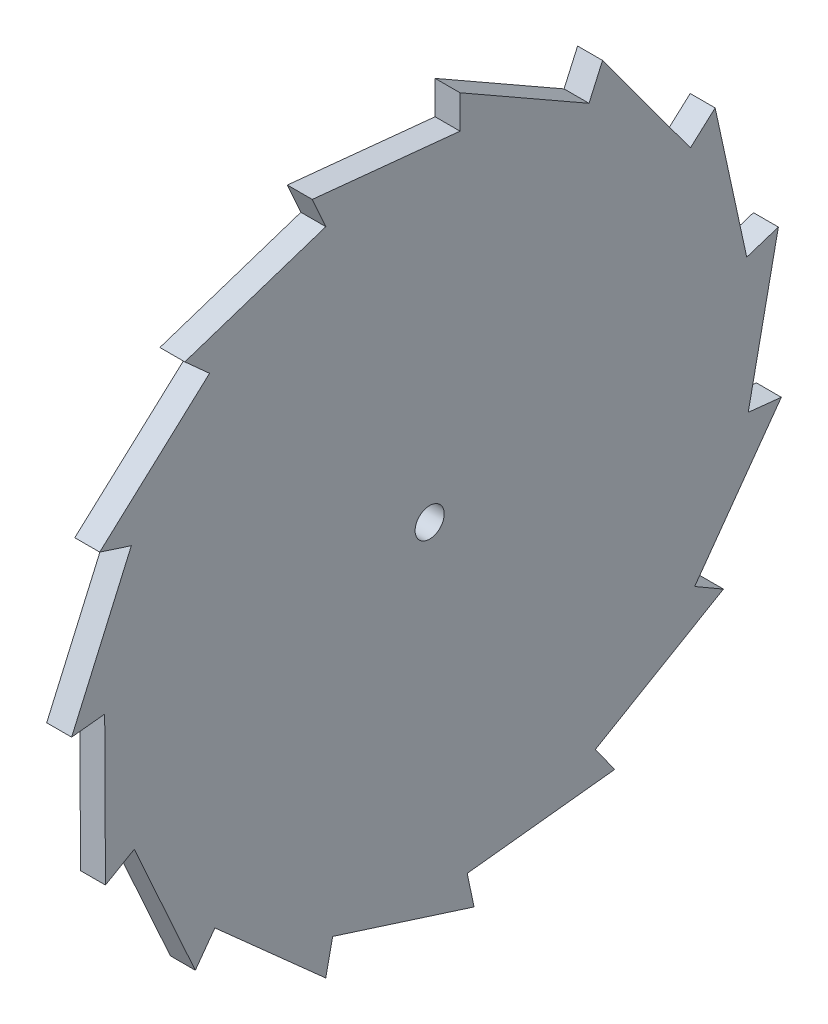
ISO-10303-21;
HEADER;
FILE_DESCRIPTION(('STEP AP214'),'2;1');
FILE_NAME('part.step','',(''),(''),'','','');
FILE_SCHEMA(('AUTOMOTIVE_DESIGN { 1 0 10303 214 1 1 1 1 }'));
ENDSEC;
DATA;
#1=APPLICATION_CONTEXT('core data for automotive mechanical design processes');
#2=APPLICATION_PROTOCOL_DEFINITION('international standard','automotive_design',2000,#1);
#3=PRODUCT_CONTEXT('',#1,'mechanical');
#4=PRODUCT('Part','Part','',(#3));
#5=PRODUCT_RELATED_PRODUCT_CATEGORY('part','',(#4));
#6=PRODUCT_DEFINITION_FORMATION('','',#4);
#7=PRODUCT_DEFINITION_CONTEXT('part definition',#1,'design');
#8=PRODUCT_DEFINITION('design','',#6,#7);
#9=PRODUCT_DEFINITION_SHAPE('','',#8);
#10=(LENGTH_UNIT() NAMED_UNIT(*) SI_UNIT(.MILLI.,.METRE.));
#11=(NAMED_UNIT(*) PLANE_ANGLE_UNIT() SI_UNIT($,.RADIAN.));
#12=(NAMED_UNIT(*) SI_UNIT($,.STERADIAN.) SOLID_ANGLE_UNIT());
#13=UNCERTAINTY_MEASURE_WITH_UNIT(LENGTH_MEASURE(1.E-05),#10,'distance_accuracy_value','');
#14=(GEOMETRIC_REPRESENTATION_CONTEXT(3) GLOBAL_UNCERTAINTY_ASSIGNED_CONTEXT((#13)) GLOBAL_UNIT_ASSIGNED_CONTEXT((#10,
#11,#12)) REPRESENTATION_CONTEXT('',''));
#15=CARTESIAN_POINT('',(0.,0.,0.));
#16=DIRECTION('',(0.,0.,1.));
#17=DIRECTION('',(1.,0.,0.));
#18=AXIS2_PLACEMENT_3D('',#15,#16,#17);
#19=CARTESIAN_POINT('',(6.,89.7129427659909,64.4689110371826));
#20=DIRECTION('',(0.,0.995040767531425,-0.0994679393094666));
#21=DIRECTION('',(0.,0.0994679393094667,0.995040767531426));
#22=AXIS2_PLACEMENT_3D('',#19,#20,#21);
#23=PLANE('',#22);
#24=DIRECTION('',(0.,-0.0994679393094667,-0.995040767531426));
#25=VECTOR('',#24,1.);
#26=CARTESIAN_POINT('',(0.,89.7129427659909,64.4689110371826));
#27=LINE('',#26,#25);
#28=CARTESIAN_POINT('',(0.,89.7129427659909,64.4689110371826));
#29=VERTEX_POINT('',#28);
#30=CARTESIAN_POINT('',(0.,86.1596380972593,28.9229549291801));
#31=VERTEX_POINT('',#30);
#32=EDGE_CURVE('E264',#29,#31,#27,.T.);
#33=ORIENTED_EDGE('',*,*,#32,.F.);
#34=DIRECTION('',(-1.,0.,0.));
#35=VECTOR('',#34,1.);
#36=CARTESIAN_POINT('',(6.,89.7129427659909,64.4689110371826));
#37=LINE('',#36,#35);
#38=CARTESIAN_POINT('',(6.,89.7129427659909,64.4689110371826));
#39=VERTEX_POINT('',#38);
#40=EDGE_CURVE('E11',#39,#29,#37,.T.);
#41=ORIENTED_EDGE('',*,*,#40,.F.);
#42=DIRECTION('',(0.,-0.0994679393094667,-0.995040767531426));
#43=VECTOR('',#42,1.);
#44=CARTESIAN_POINT('',(6.,89.7129427659909,64.4689110371826));
#45=LINE('',#44,#43);
#46=CARTESIAN_POINT('',(6.,86.1596380972593,28.9229549291801));
#47=VERTEX_POINT('',#46);
#48=EDGE_CURVE('E351',#39,#47,#45,.T.);
#49=ORIENTED_EDGE('',*,*,#48,.T.);
#50=DIRECTION('',(-1.,0.,0.));
#51=VECTOR('',#50,1.);
#52=CARTESIAN_POINT('',(6.,86.1596380972593,28.9229549291801));
#53=LINE('',#52,#51);
#54=EDGE_CURVE('E38',#47,#31,#53,.T.);
#55=ORIENTED_EDGE('',*,*,#54,.T.);
#56=EDGE_LOOP('',(#33,#41,#49,#55));
#57=FACE_BOUND('',#56,.T.);
#58=ADVANCED_FACE('F35',(#57),#23,.T.);
#59=CARTESIAN_POINT('',(6.,82.4045791048502,61.2150178925762));
#60=DIRECTION('',(0.,-0.406736643075797,0.913545457642602));
#61=DIRECTION('',(0.,-0.913545457642602,-0.406736643075797));
#62=AXIS2_PLACEMENT_3D('',#59,#60,#61);
#63=PLANE('',#62);
#64=DIRECTION('',(0.,0.913545457642602,0.406736643075797));
#65=VECTOR('',#64,1.);
#66=CARTESIAN_POINT('',(0.,82.4045791048502,61.2150178925762));
#67=LINE('',#66,#65);
#68=CARTESIAN_POINT('',(0.,82.4045791048502,61.2150178925762));
#69=VERTEX_POINT('',#68);
#70=EDGE_CURVE('E349',#69,#29,#67,.T.);
#71=ORIENTED_EDGE('',*,*,#70,.F.);
#72=DIRECTION('',(-1.,0.,0.));
#73=VECTOR('',#72,1.);
#74=CARTESIAN_POINT('',(6.,82.4045791048502,61.2150178925762));
#75=LINE('',#74,#73);
#76=CARTESIAN_POINT('',(6.,82.4045791048502,61.2150178925762));
#77=VERTEX_POINT('',#76);
#78=EDGE_CURVE('E44',#77,#69,#75,.T.);
#79=ORIENTED_EDGE('',*,*,#78,.F.);
#80=DIRECTION('',(0.,0.913545457642602,0.406736643075797));
#81=VECTOR('',#80,1.);
#82=CARTESIAN_POINT('',(6.,82.4045791048502,61.2150178925762));
#83=LINE('',#82,#81);
#84=EDGE_CURVE('E254',#77,#39,#83,.T.);
#85=ORIENTED_EDGE('',*,*,#84,.T.);
#86=ORIENTED_EDGE('',*,*,#40,.T.);
#87=EDGE_LOOP('',(#71,#79,#85,#86));
#88=FACE_BOUND('',#87,.T.);
#89=ADVANCED_FACE('F407',(#88),#63,.T.);
#90=CARTESIAN_POINT('',(6.,71.1928415823015,95.1331238453907));
#91=DIRECTION('',(0.,0.94947222907594,0.313851057372067));
#92=DIRECTION('',(0.,-0.313851057372067,0.949472229075941));
#93=AXIS2_PLACEMENT_3D('',#90,#91,#92);
#94=PLANE('',#93);
#95=DIRECTION('',(0.,0.313851057372067,-0.949472229075941));
#96=VECTOR('',#95,1.);
#97=CARTESIAN_POINT('',(0.,71.1928415823015,95.1331238453907));
#98=LINE('',#97,#96);
#99=CARTESIAN_POINT('',(0.,71.1928415823015,95.1331238453907));
#100=VERTEX_POINT('',#99);
#101=EDGE_CURVE('E241',#100,#69,#98,.T.);
#102=ORIENTED_EDGE('',*,*,#101,.F.);
#103=DIRECTION('',(-1.,0.,0.));
#104=VECTOR('',#103,1.);
#105=CARTESIAN_POINT('',(6.,71.1928415823015,95.1331238453907));
#106=LINE('',#105,#104);
#107=CARTESIAN_POINT('',(6.,71.1928415823015,95.1331238453907));
#108=VERTEX_POINT('',#107);
#109=EDGE_CURVE('E236',#108,#100,#106,.T.);
#110=ORIENTED_EDGE('',*,*,#109,.F.);
#111=DIRECTION('',(0.,0.313851057372067,-0.949472229075941));
#112=VECTOR('',#111,1.);
#113=CARTESIAN_POINT('',(6.,71.1928415823015,95.1331238453907));
#114=LINE('',#113,#112);
#115=EDGE_CURVE('E239',#108,#77,#114,.T.);
#116=ORIENTED_EDGE('',*,*,#115,.T.);
#117=ORIENTED_EDGE('',*,*,#78,.T.);
#118=EDGE_LOOP('',(#102,#110,#116,#117));
#119=FACE_BOUND('',#118,.T.);
#120=ADVANCED_FACE('F238',(#119),#94,.T.);
#121=CARTESIAN_POINT('',(6.,65.8397967314306,89.1879652415716));
#122=DIRECTION('',(0.,-0.743144825477389,0.669130606358863));
#123=DIRECTION('',(0.,-0.669130606358863,-0.74314482547739));
#124=AXIS2_PLACEMENT_3D('',#121,#122,#123);
#125=PLANE('',#124);
#126=DIRECTION('',(0.,0.669130606358863,0.74314482547739));
#127=VECTOR('',#126,1.);
#128=CARTESIAN_POINT('',(0.,65.8397967314306,89.1879652415716));
#129=LINE('',#128,#127);
#130=CARTESIAN_POINT('',(0.,65.8397967314306,89.1879652415716));
#131=VERTEX_POINT('',#130);
#132=EDGE_CURVE('E346',#131,#100,#129,.T.);
#133=ORIENTED_EDGE('',*,*,#132,.F.);
#134=DIRECTION('',(-1.,0.,0.));
#135=VECTOR('',#134,1.);
#136=CARTESIAN_POINT('',(6.,65.8397967314306,89.1879652415716));
#137=LINE('',#136,#135);
#138=CARTESIAN_POINT('',(6.,65.8397967314306,89.1879652415716));
#139=VERTEX_POINT('',#138);
#140=EDGE_CURVE('E246',#139,#131,#137,.T.);
#141=ORIENTED_EDGE('',*,*,#140,.F.);
#142=DIRECTION('',(0.,0.669130606358863,0.74314482547739));
#143=VECTOR('',#142,1.);
#144=CARTESIAN_POINT('',(6.,65.8397967314306,89.1879652415716));
#145=LINE('',#144,#143);
#146=EDGE_CURVE('E252',#139,#108,#145,.T.);
#147=ORIENTED_EDGE('',*,*,#146,.T.);
#148=ORIENTED_EDGE('',*,*,#109,.T.);
#149=EDGE_LOOP('',(#133,#141,#147,#148));
#150=FACE_BOUND('',#149,.T.);
#151=ADVANCED_FACE('F256',(#150),#125,.T.);
#152=CARTESIAN_POINT('',(6.,41.8016282906882,115.613472383637));
#153=DIRECTION('',(0.,0.739731316528816,0.672902354986624));
#154=DIRECTION('',(0.,-0.672902354986624,0.739731316528816));
#155=AXIS2_PLACEMENT_3D('',#152,#153,#154);
#156=PLANE('',#155);
#157=DIRECTION('',(0.,0.672902354986624,-0.739731316528816));
#158=VECTOR('',#157,1.);
#159=CARTESIAN_POINT('',(0.,41.8016282906882,115.613472383637));
#160=LINE('',#159,#158);
#161=CARTESIAN_POINT('',(0.,41.8016282906882,115.613472383637));
#162=VERTEX_POINT('',#161);
#163=EDGE_CURVE('E343',#162,#131,#160,.T.);
#164=ORIENTED_EDGE('',*,*,#163,.F.);
#165=DIRECTION('',(-1.,0.,0.));
#166=VECTOR('',#165,1.);
#167=CARTESIAN_POINT('',(6.,41.8016282906882,115.613472383637));
#168=LINE('',#167,#166);
#169=CARTESIAN_POINT('',(6.,41.8016282906882,115.613472383637));
#170=VERTEX_POINT('',#169);
#171=EDGE_CURVE('E355',#170,#162,#168,.T.);
#172=ORIENTED_EDGE('',*,*,#171,.F.);
#173=DIRECTION('',(0.,0.672902354986624,-0.739731316528816));
#174=VECTOR('',#173,1.);
#175=CARTESIAN_POINT('',(6.,41.8016282906882,115.613472383637));
#176=LINE('',#175,#174);
#177=EDGE_CURVE('E257',#170,#139,#176,.T.);
#178=ORIENTED_EDGE('',*,*,#177,.T.);
#179=ORIENTED_EDGE('',*,*,#140,.T.);
#180=EDGE_LOOP('',(#164,#172,#178,#179));
#181=FACE_BOUND('',#180,.T.);
#182=ADVANCED_FACE('F420',(#181),#156,.T.);
#183=CARTESIAN_POINT('',(6.,39.3294923356885,108.005020253276));
#184=DIRECTION('',(0.,-0.951056516295151,0.309016994374955));
#185=DIRECTION('',(0.,-0.309016994374955,-0.951056516295151));
#186=AXIS2_PLACEMENT_3D('',#183,#184,#185);
#187=PLANE('',#186);
#188=DIRECTION('',(0.,0.309016994374955,0.951056516295151));
#189=VECTOR('',#188,1.);
#190=CARTESIAN_POINT('',(0.,39.3294923356885,108.005020253276));
#191=LINE('',#190,#189);
#192=CARTESIAN_POINT('',(0.,39.3294923356885,108.005020253276));
#193=VERTEX_POINT('',#192);
#194=EDGE_CURVE('E340',#193,#162,#191,.T.);
#195=ORIENTED_EDGE('',*,*,#194,.F.);
#196=DIRECTION('',(-1.,0.,0.));
#197=VECTOR('',#196,1.);
#198=CARTESIAN_POINT('',(6.,39.3294923356885,108.005020253276));
#199=LINE('',#198,#197);
#200=CARTESIAN_POINT('',(6.,39.3294923356885,108.005020253276));
#201=VERTEX_POINT('',#200);
#202=EDGE_CURVE('E357',#201,#193,#199,.T.);
#203=ORIENTED_EDGE('',*,*,#202,.F.);
#204=DIRECTION('',(0.,0.309016994374955,0.951056516295151));
#205=VECTOR('',#204,1.);
#206=CARTESIAN_POINT('',(6.,39.3294923356885,108.005020253276));
#207=LINE('',#206,#205);
#208=EDGE_CURVE('E259',#201,#170,#207,.T.);
#209=ORIENTED_EDGE('',*,*,#208,.T.);
#210=ORIENTED_EDGE('',*,*,#171,.T.);
#211=EDGE_LOOP('',(#195,#203,#209,#210));
#212=FACE_BOUND('',#211,.T.);
#213=ADVANCED_FACE('F423',(#212),#187,.T.);
#214=CARTESIAN_POINT('',(6.,6.62131068006115,122.368718331534));
#215=DIRECTION('',(0.,0.402084139105821,0.915602722298012));
#216=DIRECTION('',(0.,-0.915602722298012,0.402084139105821));
#217=AXIS2_PLACEMENT_3D('',#214,#215,#216);
#218=PLANE('',#217);
#219=DIRECTION('',(0.,0.915602722298012,-0.402084139105821));
#220=VECTOR('',#219,1.);
#221=CARTESIAN_POINT('',(0.,6.62131068006115,122.368718331534));
#222=LINE('',#221,#220);
#223=CARTESIAN_POINT('',(0.,6.62131068006115,122.368718331534));
#224=VERTEX_POINT('',#223);
#225=EDGE_CURVE('E337',#224,#193,#222,.T.);
#226=ORIENTED_EDGE('',*,*,#225,.F.);
#227=DIRECTION('',(-1.,0.,0.));
#228=VECTOR('',#227,1.);
#229=CARTESIAN_POINT('',(6.,6.62131068006115,122.368718331534));
#230=LINE('',#229,#228);
#231=CARTESIAN_POINT('',(6.,6.62131068006115,122.368718331534));
#232=VERTEX_POINT('',#231);
#233=EDGE_CURVE('E359',#232,#224,#230,.T.);
#234=ORIENTED_EDGE('',*,*,#233,.F.);
#235=DIRECTION('',(0.,0.915602722298012,-0.402084139105821));
#236=VECTOR('',#235,1.);
#237=CARTESIAN_POINT('',(6.,6.62131068006115,122.368718331534));
#238=LINE('',#237,#236);
#239=EDGE_CURVE('E612',#232,#201,#238,.T.);
#240=ORIENTED_EDGE('',*,*,#239,.T.);
#241=ORIENTED_EDGE('',*,*,#202,.T.);
#242=EDGE_LOOP('',(#226,#234,#240,#241));
#243=FACE_BOUND('',#242,.T.);
#244=ADVANCED_FACE('F427',(#243),#218,.T.);
#245=CARTESIAN_POINT('',(6.,7.45753838620232,114.412543168588));
#246=DIRECTION('',(0.,-0.994521895368274,-0.104528463267646));
#247=DIRECTION('',(0.,0.104528463267646,-0.994521895368274));
#248=AXIS2_PLACEMENT_3D('',#245,#246,#247);
#249=PLANE('',#248);
#250=DIRECTION('',(0.,-0.104528463267646,0.994521895368274));
#251=VECTOR('',#250,1.);
#252=CARTESIAN_POINT('',(0.,7.45753838620232,114.412543168588));
#253=LINE('',#252,#251);
#254=CARTESIAN_POINT('',(0.,7.45753838620232,114.412543168588));
#255=VERTEX_POINT('',#254);
#256=EDGE_CURVE('E334',#255,#224,#253,.T.);
#257=ORIENTED_EDGE('',*,*,#256,.F.);
#258=DIRECTION('',(-1.,0.,0.));
#259=VECTOR('',#258,1.);
#260=CARTESIAN_POINT('',(6.,7.45753838620232,114.412543168588));
#261=LINE('',#260,#259);
#262=CARTESIAN_POINT('',(6.,7.45753838620232,114.412543168588));
#263=VERTEX_POINT('',#262);
#264=EDGE_CURVE('E361',#263,#255,#261,.T.);
#265=ORIENTED_EDGE('',*,*,#264,.F.);
#266=DIRECTION('',(0.,-0.104528463267646,0.994521895368274));
#267=VECTOR('',#266,1.);
#268=CARTESIAN_POINT('',(6.,7.45753838620232,114.412543168588));
#269=LINE('',#268,#267);
#270=EDGE_CURVE('E609',#263,#232,#269,.T.);
#271=ORIENTED_EDGE('',*,*,#270,.T.);
#272=ORIENTED_EDGE('',*,*,#233,.T.);
#273=EDGE_LOOP('',(#257,#265,#271,#272));
#274=FACE_BOUND('',#273,.T.);
#275=ADVANCED_FACE('F431',(#274),#249,.T.);
#276=CARTESIAN_POINT('',(6.,-28.26511473155,114.230818295207));
#277=DIRECTION('',(0.,-0.00508703878829938,0.999987060934473));
#278=DIRECTION('',(0.,-0.999987060934474,-0.00508703878829938));
#279=AXIS2_PLACEMENT_3D('',#276,#277,#278);
#280=PLANE('',#279);
#281=DIRECTION('',(0.,0.999987060934474,0.00508703878829938));
#282=VECTOR('',#281,1.);
#283=CARTESIAN_POINT('',(0.,-28.26511473155,114.230818295207));
#284=LINE('',#283,#282);
#285=CARTESIAN_POINT('',(0.,-28.26511473155,114.230818295207));
#286=VERTEX_POINT('',#285);
#287=EDGE_CURVE('E331',#286,#255,#284,.T.);
#288=ORIENTED_EDGE('',*,*,#287,.F.);
#289=DIRECTION('',(-1.,0.,0.));
#290=VECTOR('',#289,1.);
#291=CARTESIAN_POINT('',(6.,-28.26511473155,114.230818295207));
#292=LINE('',#291,#290);
#293=CARTESIAN_POINT('',(6.,-28.26511473155,114.230818295207));
#294=VERTEX_POINT('',#293);
#295=EDGE_CURVE('E363',#294,#286,#292,.T.);
#296=ORIENTED_EDGE('',*,*,#295,.F.);
#297=DIRECTION('',(0.,0.999987060934474,0.00508703878829938));
#298=VECTOR('',#297,1.);
#299=CARTESIAN_POINT('',(6.,-28.26511473155,114.230818295207));
#300=LINE('',#299,#298);
#301=EDGE_CURVE('E606',#294,#263,#300,.T.);
#302=ORIENTED_EDGE('',*,*,#301,.T.);
#303=ORIENTED_EDGE('',*,*,#264,.T.);
#304=EDGE_LOOP('',(#288,#296,#302,#303));
#305=FACE_BOUND('',#304,.T.);
#306=ADVANCED_FACE('F435',(#305),#280,.T.);
#307=CARTESIAN_POINT('',(6.,-24.2651147315501,107.302615064931));
#308=DIRECTION('',(0.,-0.866025403784441,-0.499999999999996));
#309=DIRECTION('',(0.,0.499999999999996,-0.866025403784441));
#310=AXIS2_PLACEMENT_3D('',#307,#308,#309);
#311=PLANE('',#310);
#312=DIRECTION('',(0.,-0.499999999999996,0.866025403784441));
#313=VECTOR('',#312,1.);
#314=CARTESIAN_POINT('',(0.,-24.2651147315501,107.302615064931));
#315=LINE('',#314,#313);
#316=CARTESIAN_POINT('',(0.,-24.2651147315501,107.302615064931));
#317=VERTEX_POINT('',#316);
#318=EDGE_CURVE('E328',#317,#286,#315,.T.);
#319=ORIENTED_EDGE('',*,*,#318,.F.);
#320=DIRECTION('',(-1.,0.,0.));
#321=VECTOR('',#320,1.);
#322=CARTESIAN_POINT('',(6.,-24.2651147315501,107.302615064931));
#323=LINE('',#322,#321);
#324=CARTESIAN_POINT('',(6.,-24.2651147315501,107.302615064931));
#325=VERTEX_POINT('',#324);
#326=EDGE_CURVE('E365',#325,#317,#323,.T.);
#327=ORIENTED_EDGE('',*,*,#326,.F.);
#328=DIRECTION('',(0.,-0.499999999999996,0.866025403784441));
#329=VECTOR('',#328,1.);
#330=CARTESIAN_POINT('',(6.,-24.2651147315501,107.302615064931));
#331=LINE('',#330,#329);
#332=EDGE_CURVE('E603',#325,#294,#331,.T.);
#333=ORIENTED_EDGE('',*,*,#332,.T.);
#334=ORIENTED_EDGE('',*,*,#295,.T.);
#335=EDGE_LOOP('',(#319,#327,#333,#334));
#336=FACE_BOUND('',#335,.T.);
#337=ADVANCED_FACE('F439',(#336),#311,.T.);
#338=CARTESIAN_POINT('',(6.,-56.8254680572527,92.6068891214375));
#339=DIRECTION('',(0.,-0.411378621461626,0.911464552138114));
#340=DIRECTION('',(0.,-0.911464552138114,-0.411378621461626));
#341=AXIS2_PLACEMENT_3D('',#338,#339,#340);
#342=PLANE('',#341);
#343=DIRECTION('',(0.,0.911464552138114,0.411378621461626));
#344=VECTOR('',#343,1.);
#345=CARTESIAN_POINT('',(0.,-56.8254680572527,92.6068891214375));
#346=LINE('',#345,#344);
#347=CARTESIAN_POINT('',(0.,-56.8254680572527,92.6068891214375));
#348=VERTEX_POINT('',#347);
#349=EDGE_CURVE('E325',#348,#317,#346,.T.);
#350=ORIENTED_EDGE('',*,*,#349,.F.);
#351=DIRECTION('',(-1.,0.,0.));
#352=VECTOR('',#351,1.);
#353=CARTESIAN_POINT('',(6.,-56.8254680572527,92.6068891214375));
#354=LINE('',#353,#352);
#355=CARTESIAN_POINT('',(6.,-56.8254680572527,92.6068891214375));
#356=VERTEX_POINT('',#355);
#357=EDGE_CURVE('E367',#356,#348,#354,.T.);
#358=ORIENTED_EDGE('',*,*,#357,.F.);
#359=DIRECTION('',(0.,0.911464552138114,0.411378621461626));
#360=VECTOR('',#359,1.);
#361=CARTESIAN_POINT('',(6.,-56.8254680572527,92.6068891214375));
#362=LINE('',#361,#360);
#363=EDGE_CURVE('E600',#356,#325,#362,.T.);
#364=ORIENTED_EDGE('',*,*,#363,.T.);
#365=ORIENTED_EDGE('',*,*,#326,.T.);
#366=EDGE_LOOP('',(#350,#358,#364,#365));
#367=FACE_BOUND('',#366,.T.);
#368=ADVANCED_FACE('F443',(#367),#342,.T.);
#369=CARTESIAN_POINT('',(6.,-50.3533321022532,87.9046071030977));
#370=DIRECTION('',(0.,-0.587785252292478,-0.809016994374944));
#371=DIRECTION('',(0.,0.809016994374944,-0.587785252292478));
#372=AXIS2_PLACEMENT_3D('',#369,#370,#371);
#373=PLANE('',#372);
#374=DIRECTION('',(0.,-0.809016994374944,0.587785252292478));
#375=VECTOR('',#374,1.);
#376=CARTESIAN_POINT('',(0.,-50.3533321022532,87.9046071030977));
#377=LINE('',#376,#375);
#378=CARTESIAN_POINT('',(0.,-50.3533321022532,87.9046071030977));
#379=VERTEX_POINT('',#378);
#380=EDGE_CURVE('E322',#379,#348,#377,.T.);
#381=ORIENTED_EDGE('',*,*,#380,.F.);
#382=DIRECTION('',(-1.,0.,0.));
#383=VECTOR('',#382,1.);
#384=CARTESIAN_POINT('',(6.,-50.3533321022532,87.9046071030977));
#385=LINE('',#384,#383);
#386=CARTESIAN_POINT('',(6.,-50.3533321022532,87.9046071030977));
#387=VERTEX_POINT('',#386);
#388=EDGE_CURVE('E369',#387,#379,#385,.T.);
#389=ORIENTED_EDGE('',*,*,#388,.F.);
#390=DIRECTION('',(0.,-0.809016994374944,0.587785252292478));
#391=VECTOR('',#390,1.);
#392=CARTESIAN_POINT('',(6.,-50.3533321022532,87.9046071030977));
#393=LINE('',#392,#391);
#394=EDGE_CURVE('E597',#387,#356,#393,.T.);
#395=ORIENTED_EDGE('',*,*,#394,.T.);
#396=ORIENTED_EDGE('',*,*,#357,.T.);
#397=EDGE_LOOP('',(#381,#389,#395,#396));
#398=FACE_BOUND('',#397,.T.);
#399=ADVANCED_FACE('F447',(#398),#373,.T.);
#400=CARTESIAN_POINT('',(6.,-74.1214047443684,61.2359046116002));
#401=DIRECTION('',(0.,-0.746539103226787,0.66534154188157));
#402=DIRECTION('',(0.,-0.66534154188157,-0.746539103226787));
#403=AXIS2_PLACEMENT_3D('',#400,#401,#402);
#404=PLANE('',#403);
#405=DIRECTION('',(0.,0.66534154188157,0.746539103226787));
#406=VECTOR('',#405,1.);
#407=CARTESIAN_POINT('',(0.,-74.1214047443684,61.2359046116002));
#408=LINE('',#407,#406);
#409=CARTESIAN_POINT('',(0.,-74.1214047443684,61.2359046116002));
#410=VERTEX_POINT('',#409);
#411=EDGE_CURVE('E319',#410,#379,#408,.T.);
#412=ORIENTED_EDGE('',*,*,#411,.F.);
#413=DIRECTION('',(-1.,0.,0.));
#414=VECTOR('',#413,1.);
#415=CARTESIAN_POINT('',(6.,-74.1214047443684,61.2359046116002));
#416=LINE('',#415,#414);
#417=CARTESIAN_POINT('',(6.,-74.1214047443684,61.2359046116002));
#418=VERTEX_POINT('',#417);
#419=EDGE_CURVE('E371',#418,#410,#416,.T.);
#420=ORIENTED_EDGE('',*,*,#419,.F.);
#421=DIRECTION('',(0.,0.66534154188157,0.746539103226787));
#422=VECTOR('',#421,1.);
#423=CARTESIAN_POINT('',(6.,-74.1214047443684,61.2359046116002));
#424=LINE('',#423,#422);
#425=EDGE_CURVE('E594',#418,#387,#424,.T.);
#426=ORIENTED_EDGE('',*,*,#425,.T.);
#427=ORIENTED_EDGE('',*,*,#388,.T.);
#428=EDGE_LOOP('',(#412,#420,#426,#427));
#429=FACE_BOUND('',#428,.T.);
#430=ADVANCED_FACE('F451',(#429),#404,.T.);
#431=CARTESIAN_POINT('',(6.,-66.2962239384979,59.5726110850581));
#432=DIRECTION('',(0.,-0.207911690817766,-0.978147600733804));
#433=DIRECTION('',(0.,0.978147600733804,-0.207911690817766));
#434=AXIS2_PLACEMENT_3D('',#431,#432,#433);
#435=PLANE('',#434);
#436=DIRECTION('',(0.,-0.978147600733804,0.207911690817766));
#437=VECTOR('',#436,1.);
#438=CARTESIAN_POINT('',(0.,-66.2962239384979,59.5726110850581));
#439=LINE('',#438,#437);
#440=CARTESIAN_POINT('',(0.,-66.2962239384979,59.5726110850581));
#441=VERTEX_POINT('',#440);
#442=EDGE_CURVE('E316',#441,#410,#439,.T.);
#443=ORIENTED_EDGE('',*,*,#442,.F.);
#444=DIRECTION('',(-1.,0.,0.));
#445=VECTOR('',#444,1.);
#446=CARTESIAN_POINT('',(6.,-66.2962239384979,59.5726110850581));
#447=LINE('',#446,#445);
#448=CARTESIAN_POINT('',(6.,-66.2962239384979,59.5726110850581));
#449=VERTEX_POINT('',#448);
#450=EDGE_CURVE('E373',#449,#441,#447,.T.);
#451=ORIENTED_EDGE('',*,*,#450,.F.);
#452=DIRECTION('',(0.,-0.978147600733804,0.207911690817766));
#453=VECTOR('',#452,1.);
#454=CARTESIAN_POINT('',(6.,-66.2962239384979,59.5726110850581));
#455=LINE('',#454,#453);
#456=EDGE_CURVE('E591',#449,#418,#455,.T.);
#457=ORIENTED_EDGE('',*,*,#456,.T.);
#458=ORIENTED_EDGE('',*,*,#419,.T.);
#459=EDGE_LOOP('',(#443,#451,#457,#458));
#460=FACE_BOUND('',#459,.T.);
#461=ADVANCED_FACE('F455',(#460),#435,.T.);
#462=CARTESIAN_POINT('',(6.,-77.1623002110427,25.5421929838929));
#463=DIRECTION('',(0.,-0.952616191949199,0.30417493459555));
#464=DIRECTION('',(0.,-0.304174934595551,-0.952616191949199));
#465=AXIS2_PLACEMENT_3D('',#462,#463,#464);
#466=PLANE('',#465);
#467=DIRECTION('',(0.,0.30417493459555,0.952616191949199));
#468=VECTOR('',#467,1.);
#469=CARTESIAN_POINT('',(0.,-77.1623002110427,25.5421929838929));
#470=LINE('',#469,#468);
#471=CARTESIAN_POINT('',(0.,-77.1623002110427,25.5421929838929));
#472=VERTEX_POINT('',#471);
#473=EDGE_CURVE('E313',#472,#441,#470,.T.);
#474=ORIENTED_EDGE('',*,*,#473,.F.);
#475=DIRECTION('',(-1.,0.,0.));
#476=VECTOR('',#475,1.);
#477=CARTESIAN_POINT('',(6.,-77.1623002110427,25.5421929838929));
#478=LINE('',#477,#476);
#479=CARTESIAN_POINT('',(6.,-77.1623002110427,25.5421929838929));
#480=VERTEX_POINT('',#479);
#481=EDGE_CURVE('E375',#480,#472,#478,.T.);
#482=ORIENTED_EDGE('',*,*,#481,.F.);
#483=DIRECTION('',(0.,0.30417493459555,0.952616191949199));
#484=VECTOR('',#483,1.);
#485=CARTESIAN_POINT('',(6.,-77.1623002110427,25.5421929838929));
#486=LINE('',#485,#484);
#487=EDGE_CURVE('E588',#480,#449,#486,.T.);
#488=ORIENTED_EDGE('',*,*,#487,.T.);
#489=ORIENTED_EDGE('',*,*,#450,.T.);
#490=EDGE_LOOP('',(#474,#482,#488,#489));
#491=FACE_BOUND('',#490,.T.);
#492=ADVANCED_FACE('F459',(#491),#466,.T.);
#493=CARTESIAN_POINT('',(6.,-69.3371194051723,27.2054865104349));
#494=DIRECTION('',(0.,0.207911690817754,-0.978147600733807));
#495=DIRECTION('',(0.,0.978147600733807,0.207911690817754));
#496=AXIS2_PLACEMENT_3D('',#493,#494,#495);
#497=PLANE('',#496);
#498=DIRECTION('',(0.,-0.978147600733807,-0.207911690817754));
#499=VECTOR('',#498,1.);
#500=CARTESIAN_POINT('',(0.,-69.3371194051723,27.2054865104349));
#501=LINE('',#500,#499);
#502=CARTESIAN_POINT('',(0.,-69.3371194051723,27.2054865104349));
#503=VERTEX_POINT('',#502);
#504=EDGE_CURVE('E310',#503,#472,#501,.T.);
#505=ORIENTED_EDGE('',*,*,#504,.F.);
#506=DIRECTION('',(-1.,0.,0.));
#507=VECTOR('',#506,1.);
#508=CARTESIAN_POINT('',(6.,-69.3371194051723,27.2054865104349));
#509=LINE('',#508,#507);
#510=CARTESIAN_POINT('',(6.,-69.3371194051723,27.2054865104349));
#511=VERTEX_POINT('',#510);
#512=EDGE_CURVE('E377',#511,#503,#509,.T.);
#513=ORIENTED_EDGE('',*,*,#512,.F.);
#514=DIRECTION('',(0.,-0.978147600733807,-0.207911690817754));
#515=VECTOR('',#514,1.);
#516=CARTESIAN_POINT('',(6.,-69.3371194051723,27.2054865104349));
#517=LINE('',#516,#515);
#518=EDGE_CURVE('E585',#511,#480,#517,.T.);
#519=ORIENTED_EDGE('',*,*,#518,.T.);
#520=ORIENTED_EDGE('',*,*,#481,.T.);
#521=EDGE_LOOP('',(#505,#513,#519,#520));
#522=FACE_BOUND('',#521,.T.);
#523=ADVANCED_FACE('F463',(#522),#497,.T.);
#524=CARTESIAN_POINT('',(6.,-65.4223560054197,-8.3024787540635));
#525=DIRECTION('',(0.,-0.993977286837178,-0.109586282224569));
#526=DIRECTION('',(0.,0.109586282224569,-0.993977286837178));
#527=AXIS2_PLACEMENT_3D('',#524,#525,#526);
#528=PLANE('',#527);
#529=DIRECTION('',(0.,-0.109586282224569,0.993977286837178));
#530=VECTOR('',#529,1.);
#531=CARTESIAN_POINT('',(0.,-65.4223560054197,-8.3024787540635));
#532=LINE('',#531,#530);
#533=CARTESIAN_POINT('',(0.,-65.4223560054197,-8.3024787540635));
#534=VERTEX_POINT('',#533);
#535=EDGE_CURVE('E307',#534,#503,#532,.T.);
#536=ORIENTED_EDGE('',*,*,#535,.F.);
#537=DIRECTION('',(-1.,0.,0.));
#538=VECTOR('',#537,1.);
#539=CARTESIAN_POINT('',(6.,-65.4223560054197,-8.3024787540635));
#540=LINE('',#539,#538);
#541=CARTESIAN_POINT('',(6.,-65.4223560054197,-8.3024787540635));
#542=VERTEX_POINT('',#541);
#543=EDGE_CURVE('E379',#542,#534,#540,.T.);
#544=ORIENTED_EDGE('',*,*,#543,.F.);
#545=DIRECTION('',(0.,-0.109586282224569,0.993977286837178));
#546=VECTOR('',#545,1.);
#547=CARTESIAN_POINT('',(6.,-65.4223560054197,-8.3024787540635));
#548=LINE('',#547,#546);
#549=EDGE_CURVE('E582',#542,#511,#548,.T.);
#550=ORIENTED_EDGE('',*,*,#549,.T.);
#551=ORIENTED_EDGE('',*,*,#512,.T.);
#552=EDGE_LOOP('',(#536,#544,#550,#551));
#553=FACE_BOUND('',#552,.T.);
#554=ADVANCED_FACE('F467',(#553),#528,.T.);
#555=CARTESIAN_POINT('',(6.,-58.9502200504201,-3.60019673572376));
#556=DIRECTION('',(0.,0.587785252292468,-0.809016994374951));
#557=DIRECTION('',(0.,0.809016994374951,0.587785252292468));
#558=AXIS2_PLACEMENT_3D('',#555,#556,#557);
#559=PLANE('',#558);
#560=DIRECTION('',(0.,-0.809016994374951,-0.587785252292468));
#561=VECTOR('',#560,1.);
#562=CARTESIAN_POINT('',(0.,-58.9502200504201,-3.60019673572376));
#563=LINE('',#562,#561);
#564=CARTESIAN_POINT('',(0.,-58.9502200504201,-3.60019673572376));
#565=VERTEX_POINT('',#564);
#566=EDGE_CURVE('E304',#565,#534,#563,.T.);
#567=ORIENTED_EDGE('',*,*,#566,.F.);
#568=DIRECTION('',(-1.,0.,0.));
#569=VECTOR('',#568,1.);
#570=CARTESIAN_POINT('',(6.,-58.9502200504201,-3.60019673572376));
#571=LINE('',#570,#569);
#572=CARTESIAN_POINT('',(6.,-58.9502200504201,-3.60019673572376));
#573=VERTEX_POINT('',#572);
#574=EDGE_CURVE('E381',#573,#565,#571,.T.);
#575=ORIENTED_EDGE('',*,*,#574,.F.);
#576=DIRECTION('',(0.,-0.809016994374951,-0.587785252292468));
#577=VECTOR('',#576,1.);
#578=CARTESIAN_POINT('',(6.,-58.9502200504201,-3.60019673572376));
#579=LINE('',#578,#577);
#580=EDGE_CURVE('E579',#573,#542,#579,.T.);
#581=ORIENTED_EDGE('',*,*,#580,.T.);
#582=ORIENTED_EDGE('',*,*,#543,.T.);
#583=EDGE_LOOP('',(#567,#575,#581,#582));
#584=FACE_BOUND('',#583,.T.);
#585=ADVANCED_FACE('F471',(#584),#559,.T.);
#586=CARTESIAN_POINT('',(6.,-40.9315151346965,-34.4460593895862));
#587=DIRECTION('',(0.,-0.863470678830842,-0.50439903528794));
#588=DIRECTION('',(0.,0.50439903528794,-0.863470678830842));
#589=AXIS2_PLACEMENT_3D('',#586,#587,#588);
#590=PLANE('',#589);
#591=DIRECTION('',(0.,-0.50439903528794,0.863470678830842));
#592=VECTOR('',#591,1.);
#593=CARTESIAN_POINT('',(0.,-40.9315151346965,-34.4460593895862));
#594=LINE('',#593,#592);
#595=CARTESIAN_POINT('',(0.,-40.9315151346965,-34.4460593895862));
#596=VERTEX_POINT('',#595);
#597=EDGE_CURVE('E301',#596,#565,#594,.T.);
#598=ORIENTED_EDGE('',*,*,#597,.F.);
#599=DIRECTION('',(-1.,0.,0.));
#600=VECTOR('',#599,1.);
#601=CARTESIAN_POINT('',(6.,-40.9315151346965,-34.4460593895862));
#602=LINE('',#601,#600);
#603=CARTESIAN_POINT('',(6.,-40.9315151346965,-34.4460593895862));
#604=VERTEX_POINT('',#603);
#605=EDGE_CURVE('E383',#604,#596,#602,.T.);
#606=ORIENTED_EDGE('',*,*,#605,.F.);
#607=DIRECTION('',(0.,-0.50439903528794,0.863470678830842));
#608=VECTOR('',#607,1.);
#609=CARTESIAN_POINT('',(6.,-40.9315151346965,-34.4460593895862));
#610=LINE('',#609,#608);
#611=EDGE_CURVE('E576',#604,#573,#610,.T.);
#612=ORIENTED_EDGE('',*,*,#611,.T.);
#613=ORIENTED_EDGE('',*,*,#574,.T.);
#614=EDGE_LOOP('',(#598,#606,#612,#613));
#615=FACE_BOUND('',#614,.T.);
#616=ADVANCED_FACE('F475',(#615),#590,.T.);
#617=CARTESIAN_POINT('',(6.,-36.9315151346964,-27.5178561593108));
#618=DIRECTION('',(0.,0.866025403784435,-0.500000000000006));
#619=DIRECTION('',(0.,0.500000000000006,0.866025403784435));
#620=AXIS2_PLACEMENT_3D('',#617,#618,#619);
#621=PLANE('',#620);
#622=DIRECTION('',(0.,-0.500000000000006,-0.866025403784435));
#623=VECTOR('',#622,1.);
#624=CARTESIAN_POINT('',(0.,-36.9315151346964,-27.5178561593108));
#625=LINE('',#624,#623);
#626=CARTESIAN_POINT('',(0.,-36.9315151346964,-27.5178561593108));
#627=VERTEX_POINT('',#626);
#628=EDGE_CURVE('E298',#627,#596,#625,.T.);
#629=ORIENTED_EDGE('',*,*,#628,.F.);
#630=DIRECTION('',(-1.,0.,0.));
#631=VECTOR('',#630,1.);
#632=CARTESIAN_POINT('',(6.,-36.9315151346964,-27.5178561593108));
#633=LINE('',#632,#631);
#634=CARTESIAN_POINT('',(6.,-36.9315151346964,-27.5178561593108));
#635=VERTEX_POINT('',#634);
#636=EDGE_CURVE('E385',#635,#627,#633,.T.);
#637=ORIENTED_EDGE('',*,*,#636,.F.);
#638=DIRECTION('',(0.,-0.500000000000006,-0.866025403784435));
#639=VECTOR('',#638,1.);
#640=CARTESIAN_POINT('',(6.,-36.9315151346964,-27.5178561593108));
#641=LINE('',#640,#639);
#642=EDGE_CURVE('E573',#635,#604,#641,.T.);
#643=ORIENTED_EDGE('',*,*,#642,.T.);
#644=ORIENTED_EDGE('',*,*,#605,.T.);
#645=EDGE_LOOP('',(#629,#637,#643,#644));
#646=FACE_BOUND('',#645,.T.);
#647=ADVANCED_FACE('F479',(#646),#621,.T.);
#648=CARTESIAN_POINT('',(6.,-7.9244664777255,-48.3680863238195));
#649=DIRECTION('',(0.,-0.5836621460698,-0.811996612828647));
#650=DIRECTION('',(0.,0.811996612828647,-0.5836621460698));
#651=AXIS2_PLACEMENT_3D('',#648,#649,#650);
#652=PLANE('',#651);
#653=DIRECTION('',(0.,-0.811996612828647,0.5836621460698));
#654=VECTOR('',#653,1.);
#655=CARTESIAN_POINT('',(0.,-7.9244664777255,-48.3680863238195));
#656=LINE('',#655,#654);
#657=CARTESIAN_POINT('',(0.,-7.9244664777255,-48.3680863238195));
#658=VERTEX_POINT('',#657);
#659=EDGE_CURVE('E295',#658,#627,#656,.T.);
#660=ORIENTED_EDGE('',*,*,#659,.F.);
#661=DIRECTION('',(-1.,0.,0.));
#662=VECTOR('',#661,1.);
#663=CARTESIAN_POINT('',(6.,-7.9244664777255,-48.3680863238195));
#664=LINE('',#663,#662);
#665=CARTESIAN_POINT('',(6.,-7.9244664777255,-48.3680863238195));
#666=VERTEX_POINT('',#665);
#667=EDGE_CURVE('E387',#666,#658,#664,.T.);
#668=ORIENTED_EDGE('',*,*,#667,.F.);
#669=DIRECTION('',(0.,-0.811996612828647,0.5836621460698));
#670=VECTOR('',#669,1.);
#671=CARTESIAN_POINT('',(6.,-7.9244664777255,-48.3680863238195));
#672=LINE('',#671,#670);
#673=EDGE_CURVE('E570',#666,#635,#672,.T.);
#674=ORIENTED_EDGE('',*,*,#673,.T.);
#675=ORIENTED_EDGE('',*,*,#636,.T.);
#676=EDGE_LOOP('',(#660,#668,#674,#675));
#677=FACE_BOUND('',#676,.T.);
#678=ADVANCED_FACE('F483',(#677),#652,.T.);
#679=CARTESIAN_POINT('',(6.,-7.08823877158422,-40.4119111608733));
#680=DIRECTION('',(0.,0.994521895368273,-0.10452846326766));
#681=DIRECTION('',(0.,0.10452846326766,0.994521895368273));
#682=AXIS2_PLACEMENT_3D('',#679,#680,#681);
#683=PLANE('',#682);
#684=DIRECTION('',(0.,-0.10452846326766,-0.994521895368273));
#685=VECTOR('',#684,1.);
#686=CARTESIAN_POINT('',(0.,-7.08823877158422,-40.4119111608733));
#687=LINE('',#686,#685);
#688=CARTESIAN_POINT('',(0.,-7.08823877158422,-40.4119111608733));
#689=VERTEX_POINT('',#688);
#690=EDGE_CURVE('E292',#689,#658,#687,.T.);
#691=ORIENTED_EDGE('',*,*,#690,.F.);
#692=DIRECTION('',(-1.,0.,0.));
#693=VECTOR('',#692,1.);
#694=CARTESIAN_POINT('',(6.,-7.08823877158422,-40.4119111608733));
#695=LINE('',#694,#693);
#696=CARTESIAN_POINT('',(6.,-7.08823877158422,-40.4119111608733));
#697=VERTEX_POINT('',#696);
#698=EDGE_CURVE('E389',#697,#689,#695,.T.);
#699=ORIENTED_EDGE('',*,*,#698,.F.);
#700=DIRECTION('',(0.,-0.10452846326766,-0.994521895368273));
#701=VECTOR('',#700,1.);
#702=CARTESIAN_POINT('',(6.,-7.08823877158422,-40.4119111608733));
#703=LINE('',#702,#701);
#704=EDGE_CURVE('E567',#697,#666,#703,.T.);
#705=ORIENTED_EDGE('',*,*,#704,.T.);
#706=ORIENTED_EDGE('',*,*,#667,.T.);
#707=EDGE_LOOP('',(#691,#699,#705,#706));
#708=FACE_BOUND('',#707,.T.);
#709=ADVANCED_FACE('F487',(#708),#683,.T.);
#710=CARTESIAN_POINT('',(6.,27.8915713930796,-47.6613146221902));
#711=DIRECTION('',(0.,-0.202933125849154,-0.979192599253636));
#712=DIRECTION('',(0.,0.979192599253636,-0.202933125849154));
#713=AXIS2_PLACEMENT_3D('',#710,#711,#712);
#714=PLANE('',#713);
#715=DIRECTION('',(0.,-0.979192599253636,0.202933125849154));
#716=VECTOR('',#715,1.);
#717=CARTESIAN_POINT('',(0.,27.8915713930796,-47.6613146221902));
#718=LINE('',#717,#716);
#719=CARTESIAN_POINT('',(0.,27.8915713930796,-47.6613146221902));
#720=VERTEX_POINT('',#719);
#721=EDGE_CURVE('E289',#720,#689,#718,.T.);
#722=ORIENTED_EDGE('',*,*,#721,.F.);
#723=DIRECTION('',(-1.,0.,0.));
#724=VECTOR('',#723,1.);
#725=CARTESIAN_POINT('',(6.,27.8915713930796,-47.6613146221902));
#726=LINE('',#725,#724);
#727=CARTESIAN_POINT('',(6.,27.8915713930796,-47.6613146221902));
#728=VERTEX_POINT('',#727);
#729=EDGE_CURVE('E391',#728,#720,#726,.T.);
#730=ORIENTED_EDGE('',*,*,#729,.F.);
#731=DIRECTION('',(0.,-0.979192599253636,0.202933125849154));
#732=VECTOR('',#731,1.);
#733=CARTESIAN_POINT('',(6.,27.8915713930796,-47.6613146221902));
#734=LINE('',#733,#732);
#735=EDGE_CURVE('E564',#728,#697,#734,.T.);
#736=ORIENTED_EDGE('',*,*,#735,.T.);
#737=ORIENTED_EDGE('',*,*,#698,.T.);
#738=EDGE_LOOP('',(#722,#730,#736,#737));
#739=FACE_BOUND('',#738,.T.);
#740=ADVANCED_FACE('F491',(#739),#714,.T.);
#741=CARTESIAN_POINT('',(6.,25.4194354380801,-40.052862491829));
#742=DIRECTION('',(0.,0.951056516295156,0.309016994374942));
#743=DIRECTION('',(0.,-0.309016994374942,0.951056516295156));
#744=AXIS2_PLACEMENT_3D('',#741,#742,#743);
#745=PLANE('',#744);
#746=DIRECTION('',(0.,0.309016994374942,-0.951056516295155));
#747=VECTOR('',#746,1.);
#748=CARTESIAN_POINT('',(0.,25.4194354380801,-40.052862491829));
#749=LINE('',#748,#747);
#750=CARTESIAN_POINT('',(0.,25.4194354380801,-40.052862491829));
#751=VERTEX_POINT('',#750);
#752=EDGE_CURVE('E286',#751,#720,#749,.T.);
#753=ORIENTED_EDGE('',*,*,#752,.F.);
#754=DIRECTION('',(-1.,0.,0.));
#755=VECTOR('',#754,1.);
#756=CARTESIAN_POINT('',(6.,25.4194354380801,-40.052862491829));
#757=LINE('',#756,#755);
#758=CARTESIAN_POINT('',(6.,25.4194354380801,-40.052862491829));
#759=VERTEX_POINT('',#758);
#760=EDGE_CURVE('E393',#759,#751,#757,.T.);
#761=ORIENTED_EDGE('',*,*,#760,.F.);
#762=DIRECTION('',(0.,0.309016994374942,-0.951056516295155));
#763=VECTOR('',#762,1.);
#764=CARTESIAN_POINT('',(6.,25.4194354380801,-40.052862491829));
#765=LINE('',#764,#763);
#766=EDGE_CURVE('E561',#759,#728,#765,.T.);
#767=ORIENTED_EDGE('',*,*,#766,.T.);
#768=ORIENTED_EDGE('',*,*,#729,.T.);
#769=EDGE_LOOP('',(#753,#761,#767,#768));
#770=FACE_BOUND('',#769,.T.);
#771=ADVANCED_FACE('F495',(#770),#745,.T.);
#772=CARTESIAN_POINT('',(6.,60.3236801513673,-32.4479515327295));
#773=DIRECTION('',(0.,0.212884875420382,-0.977077289582174));
#774=DIRECTION('',(0.,0.977077289582175,0.212884875420382));
#775=AXIS2_PLACEMENT_3D('',#772,#773,#774);
#776=PLANE('',#775);
#777=DIRECTION('',(0.,-0.977077289582175,-0.212884875420382));
#778=VECTOR('',#777,1.);
#779=CARTESIAN_POINT('',(0.,60.3236801513673,-32.4479515327295));
#780=LINE('',#779,#778);
#781=CARTESIAN_POINT('',(0.,60.3236801513673,-32.4479515327295));
#782=VERTEX_POINT('',#781);
#783=EDGE_CURVE('E283',#782,#751,#780,.T.);
#784=ORIENTED_EDGE('',*,*,#783,.F.);
#785=DIRECTION('',(-1.,0.,0.));
#786=VECTOR('',#785,1.);
#787=CARTESIAN_POINT('',(6.,60.3236801513673,-32.4479515327295));
#788=LINE('',#787,#786);
#789=CARTESIAN_POINT('',(6.,60.3236801513673,-32.4479515327295));
#790=VERTEX_POINT('',#789);
#791=EDGE_CURVE('E395',#790,#782,#788,.T.);
#792=ORIENTED_EDGE('',*,*,#791,.F.);
#793=DIRECTION('',(0.,-0.977077289582175,-0.212884875420382));
#794=VECTOR('',#793,1.);
#795=CARTESIAN_POINT('',(6.,60.3236801513673,-32.4479515327295));
#796=LINE('',#795,#794);
#797=EDGE_CURVE('E558',#790,#759,#796,.T.);
#798=ORIENTED_EDGE('',*,*,#797,.T.);
#799=ORIENTED_EDGE('',*,*,#760,.T.);
#800=EDGE_LOOP('',(#784,#792,#798,#799));
#801=FACE_BOUND('',#800,.T.);
#802=ADVANCED_FACE('F499',(#801),#776,.T.);
#803=CARTESIAN_POINT('',(6.,54.9706353004964,-26.5027929289104));
#804=DIRECTION('',(0.,0.743144825477392,0.66913060635886));
#805=DIRECTION('',(0.,-0.66913060635886,0.743144825477392));
#806=AXIS2_PLACEMENT_3D('',#803,#804,#805);
#807=PLANE('',#806);
#808=DIRECTION('',(0.,0.66913060635886,-0.743144825477392));
#809=VECTOR('',#808,1.);
#810=CARTESIAN_POINT('',(0.,54.9706353004964,-26.5027929289104));
#811=LINE('',#810,#809);
#812=CARTESIAN_POINT('',(0.,54.9706353004964,-26.5027929289104));
#813=VERTEX_POINT('',#812);
#814=EDGE_CURVE('E280',#813,#782,#811,.T.);
#815=ORIENTED_EDGE('',*,*,#814,.F.);
#816=DIRECTION('',(-1.,0.,0.));
#817=VECTOR('',#816,1.);
#818=CARTESIAN_POINT('',(6.,54.9706353004964,-26.5027929289104));
#819=LINE('',#818,#817);
#820=CARTESIAN_POINT('',(6.,54.9706353004964,-26.5027929289104));
#821=VERTEX_POINT('',#820);
#822=EDGE_CURVE('E397',#821,#813,#819,.T.);
#823=ORIENTED_EDGE('',*,*,#822,.F.);
#824=DIRECTION('',(0.,0.66913060635886,-0.743144825477392));
#825=VECTOR('',#824,1.);
#826=CARTESIAN_POINT('',(6.,54.9706353004964,-26.5027929289104));
#827=LINE('',#826,#825);
#828=EDGE_CURVE('E555',#821,#790,#827,.T.);
#829=ORIENTED_EDGE('',*,*,#828,.T.);
#830=ORIENTED_EDGE('',*,*,#791,.T.);
#831=EDGE_LOOP('',(#815,#823,#829,#830));
#832=FACE_BOUND('',#831,.T.);
#833=ADVANCED_FACE('F503',(#832),#807,.T.);
#834=CARTESIAN_POINT('',(6.,83.7640535563713,-5.35852574266989));
#835=DIRECTION('',(0.,0.591893147731356,-0.806016440073444));
#836=DIRECTION('',(0.,0.806016440073444,0.591893147731356));
#837=AXIS2_PLACEMENT_3D('',#834,#835,#836);
#838=PLANE('',#837);
#839=DIRECTION('',(0.,-0.806016440073444,-0.591893147731356));
#840=VECTOR('',#839,1.);
#841=CARTESIAN_POINT('',(0.,83.7640535563713,-5.35852574266989));
#842=LINE('',#841,#840);
#843=CARTESIAN_POINT('',(0.,83.7640535563713,-5.35852574266989));
#844=VERTEX_POINT('',#843);
#845=EDGE_CURVE('E277',#844,#813,#842,.T.);
#846=ORIENTED_EDGE('',*,*,#845,.F.);
#847=DIRECTION('',(-1.,0.,0.));
#848=VECTOR('',#847,1.);
#849=CARTESIAN_POINT('',(6.,83.7640535563713,-5.35852574266989));
#850=LINE('',#849,#848);
#851=CARTESIAN_POINT('',(6.,83.7640535563713,-5.35852574266989));
#852=VERTEX_POINT('',#851);
#853=EDGE_CURVE('E399',#852,#844,#850,.T.);
#854=ORIENTED_EDGE('',*,*,#853,.F.);
#855=DIRECTION('',(0.,-0.806016440073444,-0.591893147731356));
#856=VECTOR('',#855,1.);
#857=CARTESIAN_POINT('',(6.,83.7640535563713,-5.35852574266989));
#858=LINE('',#857,#856);
#859=EDGE_CURVE('E552',#852,#821,#858,.T.);
#860=ORIENTED_EDGE('',*,*,#859,.T.);
#861=ORIENTED_EDGE('',*,*,#822,.T.);
#862=EDGE_LOOP('',(#846,#854,#860,#861));
#863=FACE_BOUND('',#862,.T.);
#864=ADVANCED_FACE('F507',(#863),#838,.T.);
#865=CARTESIAN_POINT('',(6.,76.4556898952305,-2.1046325980635));
#866=DIRECTION('',(0.,0.406736643075799,0.913545457642602));
#867=DIRECTION('',(0.,-0.913545457642602,0.406736643075799));
#868=AXIS2_PLACEMENT_3D('',#865,#866,#867);
#869=PLANE('',#868);
#870=DIRECTION('',(0.,0.913545457642602,-0.406736643075799));
#871=VECTOR('',#870,1.);
#872=CARTESIAN_POINT('',(0.,76.4556898952305,-2.1046325980635));
#873=LINE('',#872,#871);
#874=CARTESIAN_POINT('',(0.,76.4556898952305,-2.1046325980635));
#875=VERTEX_POINT('',#874);
#876=EDGE_CURVE('E274',#875,#844,#873,.T.);
#877=ORIENTED_EDGE('',*,*,#876,.F.);
#878=DIRECTION('',(-1.,0.,0.));
#879=VECTOR('',#878,1.);
#880=CARTESIAN_POINT('',(6.,76.4556898952305,-2.1046325980635));
#881=LINE('',#880,#879);
#882=CARTESIAN_POINT('',(6.,76.4556898952305,-2.1046325980635));
#883=VERTEX_POINT('',#882);
#884=EDGE_CURVE('E401',#883,#875,#881,.T.);
#885=ORIENTED_EDGE('',*,*,#884,.F.);
#886=DIRECTION('',(0.,0.913545457642602,-0.406736643075799));
#887=VECTOR('',#886,1.);
#888=CARTESIAN_POINT('',(6.,76.4556898952305,-2.1046325980635));
#889=LINE('',#888,#887);
#890=EDGE_CURVE('E549',#883,#852,#889,.T.);
#891=ORIENTED_EDGE('',*,*,#890,.T.);
#892=ORIENTED_EDGE('',*,*,#853,.T.);
#893=EDGE_LOOP('',(#877,#885,#891,#892));
#894=FACE_BOUND('',#893,.T.);
#895=ADVANCED_FACE('F511',(#894),#869,.T.);
#896=CARTESIAN_POINT('',(6.,94.1596380972593,28.92295492918));
#897=DIRECTION('',(0.,0.86855771761914,-0.495588025646534));
#898=DIRECTION('',(0.,0.495588025646534,0.86855771761914));
#899=AXIS2_PLACEMENT_3D('',#896,#897,#898);
#900=PLANE('',#899);
#901=DIRECTION('',(0.,-0.495588025646534,-0.86855771761914));
#902=VECTOR('',#901,1.);
#903=CARTESIAN_POINT('',(0.,94.1596380972593,28.92295492918));
#904=LINE('',#903,#902);
#905=CARTESIAN_POINT('',(0.,94.1596380972593,28.92295492918));
#906=VERTEX_POINT('',#905);
#907=EDGE_CURVE('E271',#906,#875,#904,.T.);
#908=ORIENTED_EDGE('',*,*,#907,.F.);
#909=DIRECTION('',(-1.,0.,0.));
#910=VECTOR('',#909,1.);
#911=CARTESIAN_POINT('',(6.,94.1596380972593,28.92295492918));
#912=LINE('',#911,#910);
#913=CARTESIAN_POINT('',(6.,94.1596380972593,28.92295492918));
#914=VERTEX_POINT('',#913);
#915=EDGE_CURVE('E402',#914,#906,#912,.T.);
#916=ORIENTED_EDGE('',*,*,#915,.F.);
#917=DIRECTION('',(0.,-0.495588025646534,-0.86855771761914));
#918=VECTOR('',#917,1.);
#919=CARTESIAN_POINT('',(6.,94.1596380972593,28.92295492918));
#920=LINE('',#919,#918);
#921=EDGE_CURVE('E546',#914,#883,#920,.T.);
#922=ORIENTED_EDGE('',*,*,#921,.T.);
#923=ORIENTED_EDGE('',*,*,#884,.T.);
#924=EDGE_LOOP('',(#908,#916,#922,#923));
#925=FACE_BOUND('',#924,.T.);
#926=ADVANCED_FACE('F515',(#925),#900,.T.);
#927=CARTESIAN_POINT('',(6.,86.1596380972593,28.9229549291801));
#928=DIRECTION('',(0.,0.,1.));
#929=DIRECTION('',(0.,-1.,0.));
#930=AXIS2_PLACEMENT_3D('',#927,#928,#929);
#931=PLANE('',#930);
#932=DIRECTION('',(0.,1.,0.));
#933=VECTOR('',#932,1.);
#934=CARTESIAN_POINT('',(0.,86.1596380972593,28.9229549291801));
#935=LINE('',#934,#933);
#936=EDGE_CURVE('E267',#31,#906,#935,.T.);
#937=ORIENTED_EDGE('',*,*,#936,.F.);
#938=ORIENTED_EDGE('',*,*,#54,.F.);
#939=DIRECTION('',(0.,1.,0.));
#940=VECTOR('',#939,1.);
#941=CARTESIAN_POINT('',(6.,86.1596380972593,28.9229549291801));
#942=LINE('',#941,#940);
#943=EDGE_CURVE('E544',#47,#914,#942,.T.);
#944=ORIENTED_EDGE('',*,*,#943,.T.);
#945=ORIENTED_EDGE('',*,*,#915,.T.);
#946=EDGE_LOOP('',(#937,#938,#944,#945));
#947=FACE_BOUND('',#946,.T.);
#948=ADVANCED_FACE('F404',(#947),#931,.T.);
#949=CARTESIAN_POINT('',(6.,0.,0.));
#950=DIRECTION('',(1.,0.,0.));
#951=DIRECTION('',(0.,0.,-1.));
#952=AXIS2_PLACEMENT_3D('',#949,#950,#951);
#953=PLANE('',#952);
#954=CARTESIAN_POINT('',(6.,8.32100274367092,36.2359046116002));
#955=DIRECTION('',(-1.,0.,0.));
#956=DIRECTION('',(0.,0.,1.));
#957=AXIS2_PLACEMENT_3D('',#954,#955,#956);
#958=CIRCLE('',#957,3.5);
#959=CARTESIAN_POINT('',(6.,8.32100274367092,39.7359046116002));
#960=VERTEX_POINT('',#959);
#961=EDGE_CURVE('E268',#960,#960,#958,.T.);
#962=ORIENTED_EDGE('',*,*,#961,.T.);
#963=EDGE_LOOP('',(#962));
#964=FACE_BOUND('',#963,.T.);
#965=ORIENTED_EDGE('',*,*,#48,.F.);
#966=ORIENTED_EDGE('',*,*,#84,.F.);
#967=ORIENTED_EDGE('',*,*,#115,.F.);
#968=ORIENTED_EDGE('',*,*,#146,.F.);
#969=ORIENTED_EDGE('',*,*,#177,.F.);
#970=ORIENTED_EDGE('',*,*,#208,.F.);
#971=ORIENTED_EDGE('',*,*,#239,.F.);
#972=ORIENTED_EDGE('',*,*,#270,.F.);
#973=ORIENTED_EDGE('',*,*,#301,.F.);
#974=ORIENTED_EDGE('',*,*,#332,.F.);
#975=ORIENTED_EDGE('',*,*,#363,.F.);
#976=ORIENTED_EDGE('',*,*,#394,.F.);
#977=ORIENTED_EDGE('',*,*,#425,.F.);
#978=ORIENTED_EDGE('',*,*,#456,.F.);
#979=ORIENTED_EDGE('',*,*,#487,.F.);
#980=ORIENTED_EDGE('',*,*,#518,.F.);
#981=ORIENTED_EDGE('',*,*,#549,.F.);
#982=ORIENTED_EDGE('',*,*,#580,.F.);
#983=ORIENTED_EDGE('',*,*,#611,.F.);
#984=ORIENTED_EDGE('',*,*,#642,.F.);
#985=ORIENTED_EDGE('',*,*,#673,.F.);
#986=ORIENTED_EDGE('',*,*,#704,.F.);
#987=ORIENTED_EDGE('',*,*,#735,.F.);
#988=ORIENTED_EDGE('',*,*,#766,.F.);
#989=ORIENTED_EDGE('',*,*,#797,.F.);
#990=ORIENTED_EDGE('',*,*,#828,.F.);
#991=ORIENTED_EDGE('',*,*,#859,.F.);
#992=ORIENTED_EDGE('',*,*,#890,.F.);
#993=ORIENTED_EDGE('',*,*,#921,.F.);
#994=ORIENTED_EDGE('',*,*,#943,.F.);
#995=EDGE_LOOP('',(#965,#966,#967,#968,#969,#970,#971,#972,#973,#974,#975,#976,#977,#978,#979,
#980,#981,#982,#983,#984,#985,#986,#987,#988,#989,#990,#991,#992,#993,#994));
#996=FACE_BOUND('',#995,.T.);
#997=ADVANCED_FACE('F250',(#964,#996),#953,.T.);
#998=CARTESIAN_POINT('',(0.,0.,0.));
#999=DIRECTION('',(1.,0.,0.));
#1000=DIRECTION('',(0.,0.,-1.));
#1001=AXIS2_PLACEMENT_3D('',#998,#999,#1000);
#1002=PLANE('',#1001);
#1003=CARTESIAN_POINT('',(0.,8.32100274367092,36.2359046116002));
#1004=DIRECTION('',(-1.,0.,0.));
#1005=DIRECTION('',(0.,0.,1.));
#1006=AXIS2_PLACEMENT_3D('',#1003,#1004,#1005);
#1007=CIRCLE('',#1006,3.49999999999999);
#1008=CARTESIAN_POINT('',(0.,8.32100274367092,39.7359046116002));
#1009=VERTEX_POINT('',#1008);
#1010=EDGE_CURVE('E539',#1009,#1009,#1007,.T.);
#1011=ORIENTED_EDGE('',*,*,#1010,.F.);
#1012=EDGE_LOOP('',(#1011));
#1013=FACE_BOUND('',#1012,.T.);
#1014=ORIENTED_EDGE('',*,*,#32,.T.);
#1015=ORIENTED_EDGE('',*,*,#936,.T.);
#1016=ORIENTED_EDGE('',*,*,#907,.T.);
#1017=ORIENTED_EDGE('',*,*,#876,.T.);
#1018=ORIENTED_EDGE('',*,*,#845,.T.);
#1019=ORIENTED_EDGE('',*,*,#814,.T.);
#1020=ORIENTED_EDGE('',*,*,#783,.T.);
#1021=ORIENTED_EDGE('',*,*,#752,.T.);
#1022=ORIENTED_EDGE('',*,*,#721,.T.);
#1023=ORIENTED_EDGE('',*,*,#690,.T.);
#1024=ORIENTED_EDGE('',*,*,#659,.T.);
#1025=ORIENTED_EDGE('',*,*,#628,.T.);
#1026=ORIENTED_EDGE('',*,*,#597,.T.);
#1027=ORIENTED_EDGE('',*,*,#566,.T.);
#1028=ORIENTED_EDGE('',*,*,#535,.T.);
#1029=ORIENTED_EDGE('',*,*,#504,.T.);
#1030=ORIENTED_EDGE('',*,*,#473,.T.);
#1031=ORIENTED_EDGE('',*,*,#442,.T.);
#1032=ORIENTED_EDGE('',*,*,#411,.T.);
#1033=ORIENTED_EDGE('',*,*,#380,.T.);
#1034=ORIENTED_EDGE('',*,*,#349,.T.);
#1035=ORIENTED_EDGE('',*,*,#318,.T.);
#1036=ORIENTED_EDGE('',*,*,#287,.T.);
#1037=ORIENTED_EDGE('',*,*,#256,.T.);
#1038=ORIENTED_EDGE('',*,*,#225,.T.);
#1039=ORIENTED_EDGE('',*,*,#194,.T.);
#1040=ORIENTED_EDGE('',*,*,#163,.T.);
#1041=ORIENTED_EDGE('',*,*,#132,.T.);
#1042=ORIENTED_EDGE('',*,*,#101,.T.);
#1043=ORIENTED_EDGE('',*,*,#70,.T.);
#1044=EDGE_LOOP('',(#1014,#1015,#1016,#1017,#1018,#1019,#1020,#1021,#1022,#1023,#1024,#1025,
#1026,#1027,#1028,#1029,#1030,#1031,#1032,#1033,#1034,#1035,#1036,#1037,#1038,#1039,#1040,#1041,
#1042,#1043));
#1045=FACE_BOUND('',#1044,.T.);
#1046=ADVANCED_FACE('F406',(#1013,#1045),#1002,.F.);
#1047=CARTESIAN_POINT('',(0.,8.32100274367092,36.2359046116002));
#1048=DIRECTION('',(-1.,0.,0.));
#1049=DIRECTION('',(0.,0.,1.));
#1050=AXIS2_PLACEMENT_3D('',#1047,#1048,#1049);
#1051=CYLINDRICAL_SURFACE('',#1050,3.49999999999999);
#1052=ORIENTED_EDGE('',*,*,#961,.F.);
#1053=EDGE_LOOP('',(#1052));
#1054=FACE_BOUND('',#1053,.T.);
#1055=ORIENTED_EDGE('',*,*,#1010,.T.);
#1056=EDGE_LOOP('',(#1055));
#1057=FACE_BOUND('',#1056,.T.);
#1058=ADVANCED_FACE('F527',(#1054,#1057),#1051,.F.);
#1059=CLOSED_SHELL('',(#58,#89,#120,#151,#182,#213,#244,#275,#306,#337,#368,#399,#430,#461,#492,
#523,#554,#585,#616,#647,#678,#709,#740,#771,#802,#833,#864,#895,#926,#948,#997,#1046,#1058));
#1060=MANIFOLD_SOLID_BREP('B2',#1059);
#1061=ADVANCED_BREP_SHAPE_REPRESENTATION('',(#18,#1060),#14);
#1062=SHAPE_DEFINITION_REPRESENTATION(#9,#1061);
ENDSEC;
END-ISO-10303-21;
